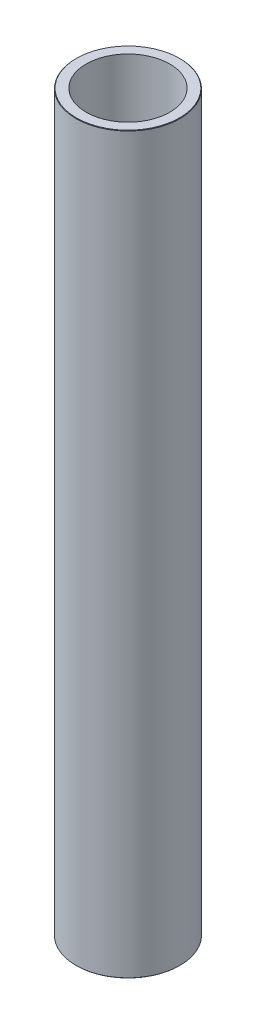
ISO-10303-21;
HEADER;
FILE_DESCRIPTION(('STEP AP214'),'2;1');
FILE_NAME('part.step','',(''),(''),'','','');
FILE_SCHEMA(('AUTOMOTIVE_DESIGN { 1 0 10303 214 1 1 1 1 }'));
ENDSEC;
DATA;
#1=APPLICATION_CONTEXT('core data for automotive mechanical design processes');
#2=APPLICATION_PROTOCOL_DEFINITION('international standard','automotive_design',2000,#1);
#3=PRODUCT_CONTEXT('',#1,'mechanical');
#4=PRODUCT('Part','Part','',(#3));
#5=PRODUCT_RELATED_PRODUCT_CATEGORY('part','',(#4));
#6=PRODUCT_DEFINITION_FORMATION('','',#4);
#7=PRODUCT_DEFINITION_CONTEXT('part definition',#1,'design');
#8=PRODUCT_DEFINITION('design','',#6,#7);
#9=PRODUCT_DEFINITION_SHAPE('','',#8);
#10=(LENGTH_UNIT() NAMED_UNIT(*) SI_UNIT(.MILLI.,.METRE.));
#11=(NAMED_UNIT(*) PLANE_ANGLE_UNIT() SI_UNIT($,.RADIAN.));
#12=(NAMED_UNIT(*) SI_UNIT($,.STERADIAN.) SOLID_ANGLE_UNIT());
#13=UNCERTAINTY_MEASURE_WITH_UNIT(LENGTH_MEASURE(1.E-05),#10,'distance_accuracy_value','');
#14=(GEOMETRIC_REPRESENTATION_CONTEXT(3) GLOBAL_UNCERTAINTY_ASSIGNED_CONTEXT((#13)) GLOBAL_UNIT_ASSIGNED_CONTEXT((#10,
#11,#12)) REPRESENTATION_CONTEXT('',''));
#15=CARTESIAN_POINT('',(0.,0.,0.));
#16=DIRECTION('',(0.,0.,1.));
#17=DIRECTION('',(1.,0.,0.));
#18=AXIS2_PLACEMENT_3D('',#15,#16,#17);
#19=CARTESIAN_POINT('',(0.,600.,0.));
#20=DIRECTION('',(0.,-1.,0.));
#21=DIRECTION('',(0.,0.,-1.));
#22=AXIS2_PLACEMENT_3D('',#19,#20,#21);
#23=CYLINDRICAL_SURFACE('',#22,42.5);
#24=CARTESIAN_POINT('',(0.,599.635033007769,0.));
#25=DIRECTION('',(0.,1.,0.));
#26=DIRECTION('',(0.,0.,1.));
#27=AXIS2_PLACEMENT_3D('',#24,#25,#26);
#28=CIRCLE('',#27,42.5);
#29=CARTESIAN_POINT('',(0.,599.635033007769,42.5));
#30=VERTEX_POINT('',#29);
#31=EDGE_CURVE('E50',#30,#30,#28,.F.);
#32=ORIENTED_EDGE('',*,*,#31,.T.);
#33=EDGE_LOOP('',(#32));
#34=FACE_BOUND('',#33,.T.);
#35=CARTESIAN_POINT('',(0.,0.360566704993848,0.));
#36=DIRECTION('',(0.,1.,0.));
#37=DIRECTION('',(0.,0.,1.));
#38=AXIS2_PLACEMENT_3D('',#35,#36,#37);
#39=CIRCLE('',#38,42.5);
#40=CARTESIAN_POINT('',(0.,0.360566704993848,42.5));
#41=VERTEX_POINT('',#40);
#42=EDGE_CURVE('E51',#41,#41,#39,.T.);
#43=ORIENTED_EDGE('',*,*,#42,.T.);
#44=EDGE_LOOP('',(#43));
#45=FACE_BOUND('',#44,.T.);
#46=ADVANCED_FACE('F39',(#34,#45),#23,.T.);
#47=CARTESIAN_POINT('',(0.,600.,0.));
#48=DIRECTION('',(0.,1.,0.));
#49=DIRECTION('',(0.,0.,1.));
#50=AXIS2_PLACEMENT_3D('',#47,#48,#49);
#51=PLANE('',#50);
#52=CARTESIAN_POINT('',(0.,600.,0.));
#53=DIRECTION('',(0.,1.,0.));
#54=DIRECTION('',(0.,0.,1.));
#55=AXIS2_PLACEMENT_3D('',#52,#53,#54);
#56=CIRCLE('',#55,42.1394332950064);
#57=CARTESIAN_POINT('',(0.,600.,42.1394332950064));
#58=VERTEX_POINT('',#57);
#59=EDGE_CURVE('E54',#58,#58,#56,.T.);
#60=ORIENTED_EDGE('',*,*,#59,.T.);
#61=EDGE_LOOP('',(#60));
#62=FACE_BOUND('',#61,.T.);
#63=CARTESIAN_POINT('',(0.,600.,0.));
#64=DIRECTION('',(0.,1.,0.));
#65=DIRECTION('',(0.,0.,1.));
#66=AXIS2_PLACEMENT_3D('',#63,#64,#65);
#67=CIRCLE('',#66,34.1850746908381);
#68=CARTESIAN_POINT('',(0.,600.,34.1850746908381));
#69=VERTEX_POINT('',#68);
#70=EDGE_CURVE('E58',#69,#69,#67,.T.);
#71=ORIENTED_EDGE('',*,*,#70,.F.);
#72=EDGE_LOOP('',(#71));
#73=FACE_BOUND('',#72,.T.);
#74=ADVANCED_FACE('F69',(#62,#73),#51,.T.);
#75=CARTESIAN_POINT('',(0.,0.,0.));
#76=DIRECTION('',(0.,1.,0.));
#77=DIRECTION('',(0.,0.,1.));
#78=AXIS2_PLACEMENT_3D('',#75,#76,#77);
#79=PLANE('',#78);
#80=CARTESIAN_POINT('',(0.,0.,0.));
#81=DIRECTION('',(0.,1.,0.));
#82=DIRECTION('',(0.,0.,1.));
#83=AXIS2_PLACEMENT_3D('',#80,#81,#82);
#84=CIRCLE('',#83,42.1350330077689);
#85=CARTESIAN_POINT('',(0.,0.,42.1350330077689));
#86=VERTEX_POINT('',#85);
#87=EDGE_CURVE('E10',#86,#86,#84,.F.);
#88=ORIENTED_EDGE('',*,*,#87,.T.);
#89=EDGE_LOOP('',(#88));
#90=FACE_BOUND('',#89,.T.);
#91=CARTESIAN_POINT('',(0.,0.,0.));
#92=DIRECTION('',(0.,1.,0.));
#93=DIRECTION('',(0.,0.,1.));
#94=AXIS2_PLACEMENT_3D('',#91,#92,#93);
#95=CIRCLE('',#94,34.1850746908381);
#96=CARTESIAN_POINT('',(0.,0.,34.1850746908381));
#97=VERTEX_POINT('',#96);
#98=EDGE_CURVE('E63',#97,#97,#95,.T.);
#99=ORIENTED_EDGE('',*,*,#98,.T.);
#100=EDGE_LOOP('',(#99));
#101=FACE_BOUND('',#100,.T.);
#102=ADVANCED_FACE('F75',(#90,#101),#79,.F.);
#103=CARTESIAN_POINT('',(0.,600.,0.));
#104=DIRECTION('',(0.,-1.,0.));
#105=DIRECTION('',(0.,0.,-1.));
#106=AXIS2_PLACEMENT_3D('',#103,#104,#105);
#107=CYLINDRICAL_SURFACE('',#106,34.1850746908381);
#108=ORIENTED_EDGE('',*,*,#70,.T.);
#109=EDGE_LOOP('',(#108));
#110=FACE_BOUND('',#109,.T.);
#111=ORIENTED_EDGE('',*,*,#98,.F.);
#112=EDGE_LOOP('',(#111));
#113=FACE_BOUND('',#112,.T.);
#114=ADVANCED_FACE('F70',(#110,#113),#107,.F.);
#115=CARTESIAN_POINT('',(0.,600.,0.));
#116=DIRECTION('',(0.,-1.,0.));
#117=DIRECTION('',(0.,0.,-1.));
#118=AXIS2_PLACEMENT_3D('',#115,#116,#117);
#119=CONICAL_SURFACE('',#118,42.1394332950064,0.779333340628254);
#120=ORIENTED_EDGE('',*,*,#31,.F.);
#121=EDGE_LOOP('',(#120));
#122=FACE_BOUND('',#121,.T.);
#123=ORIENTED_EDGE('',*,*,#59,.F.);
#124=EDGE_LOOP('',(#123));
#125=FACE_BOUND('',#124,.T.);
#126=ADVANCED_FACE('F81',(#122,#125),#119,.T.);
#127=CARTESIAN_POINT('',(0.,0.360566704993848,0.));
#128=DIRECTION('',(0.,1.,0.));
#129=DIRECTION('',(0.,0.,1.));
#130=AXIS2_PLACEMENT_3D('',#127,#128,#129);
#131=CONICAL_SURFACE('',#130,42.5,0.791462986166411);
#132=ORIENTED_EDGE('',*,*,#87,.F.);
#133=EDGE_LOOP('',(#132));
#134=FACE_BOUND('',#133,.T.);
#135=ORIENTED_EDGE('',*,*,#42,.F.);
#136=EDGE_LOOP('',(#135));
#137=FACE_BOUND('',#136,.T.);
#138=ADVANCED_FACE('F45',(#134,#137),#131,.T.);
#139=CLOSED_SHELL('',(#46,#74,#102,#114,#126,#138));
#140=MANIFOLD_SOLID_BREP('B2',#139);
#141=ADVANCED_BREP_SHAPE_REPRESENTATION('',(#18,#140),#14);
#142=SHAPE_DEFINITION_REPRESENTATION(#9,#141);
ENDSEC;
END-ISO-10303-21;
